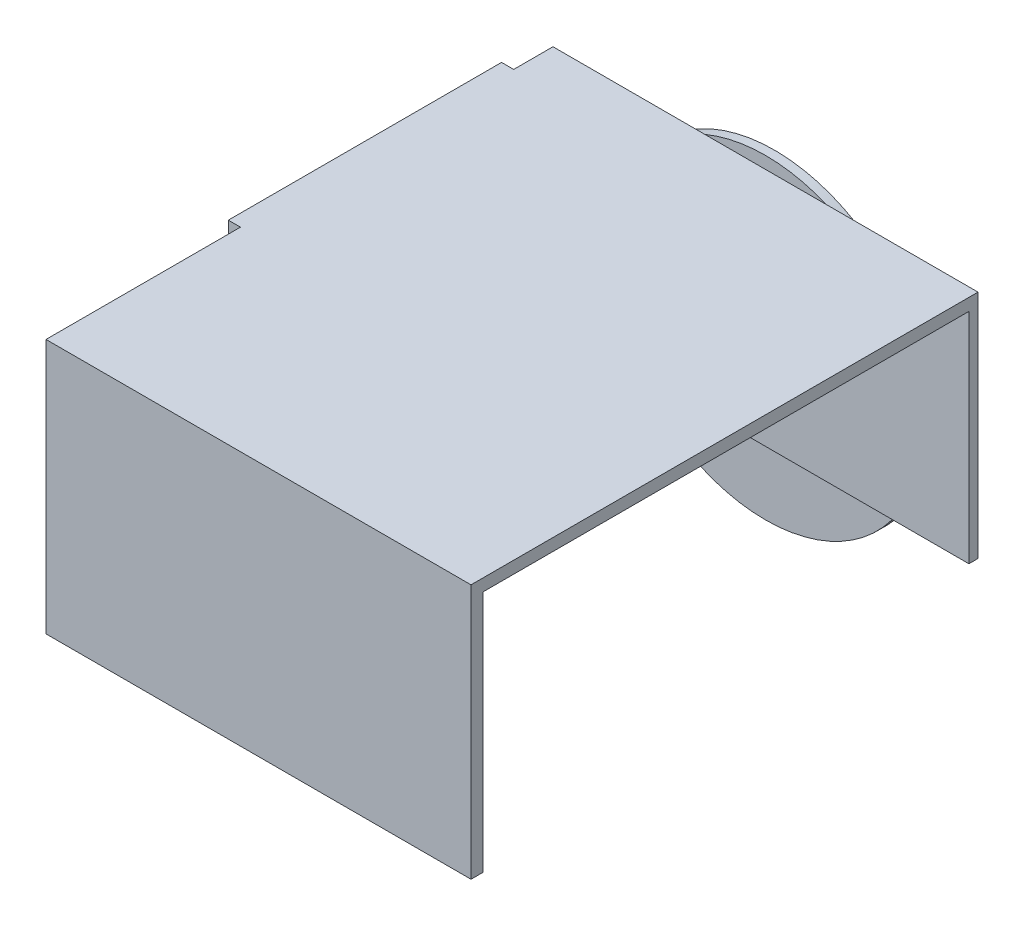
ISO-10303-21;
HEADER;
FILE_DESCRIPTION(('STEP AP214'),'2;1');
FILE_NAME('part.step','',(''),(''),'','','');
FILE_SCHEMA(('AUTOMOTIVE_DESIGN { 1 0 10303 214 1 1 1 1 }'));
ENDSEC;
DATA;
#1=APPLICATION_CONTEXT('core data for automotive mechanical design processes');
#2=APPLICATION_PROTOCOL_DEFINITION('international standard','automotive_design',2000,#1);
#3=PRODUCT_CONTEXT('',#1,'mechanical');
#4=PRODUCT('Part','Part','',(#3));
#5=PRODUCT_RELATED_PRODUCT_CATEGORY('part','',(#4));
#6=PRODUCT_DEFINITION_FORMATION('','',#4);
#7=PRODUCT_DEFINITION_CONTEXT('part definition',#1,'design');
#8=PRODUCT_DEFINITION('design','',#6,#7);
#9=PRODUCT_DEFINITION_SHAPE('','',#8);
#10=(LENGTH_UNIT() NAMED_UNIT(*) SI_UNIT(.MILLI.,.METRE.));
#11=(NAMED_UNIT(*) PLANE_ANGLE_UNIT() SI_UNIT($,.RADIAN.));
#12=(NAMED_UNIT(*) SI_UNIT($,.STERADIAN.) SOLID_ANGLE_UNIT());
#13=UNCERTAINTY_MEASURE_WITH_UNIT(LENGTH_MEASURE(1.E-05),#10,'distance_accuracy_value','');
#14=(GEOMETRIC_REPRESENTATION_CONTEXT(3) GLOBAL_UNCERTAINTY_ASSIGNED_CONTEXT((#13)) GLOBAL_UNIT_ASSIGNED_CONTEXT((#10,
#11,#12)) REPRESENTATION_CONTEXT('',''));
#15=CARTESIAN_POINT('',(0.,0.,0.));
#16=DIRECTION('',(0.,0.,1.));
#17=DIRECTION('',(1.,0.,0.));
#18=AXIS2_PLACEMENT_3D('',#15,#16,#17);
#19=CARTESIAN_POINT('',(-35.,24.,3.));
#20=DIRECTION('',(1.,0.,0.));
#21=DIRECTION('',(0.,0.,-1.));
#22=AXIS2_PLACEMENT_3D('',#19,#20,#21);
#23=PLANE('',#22);
#24=DIRECTION('',(0.,-1.,0.));
#25=VECTOR('',#24,1.);
#26=CARTESIAN_POINT('',(-35.,22.,7.97068975111986));
#27=LINE('',#26,#25);
#28=CARTESIAN_POINT('',(-35.,24.,7.97068975111987));
#29=VERTEX_POINT('',#28);
#30=CARTESIAN_POINT('',(-35.,22.,7.97068975111988));
#31=VERTEX_POINT('',#30);
#32=EDGE_CURVE('E57',#29,#31,#27,.T.);
#33=ORIENTED_EDGE('',*,*,#32,.F.);
#34=DIRECTION('',(0.,0.,-1.));
#35=VECTOR('',#34,1.);
#36=CARTESIAN_POINT('',(-35.,24.,3.));
#37=LINE('',#36,#35);
#38=CARTESIAN_POINT('',(-35.,24.,1.5));
#39=VERTEX_POINT('',#38);
#40=EDGE_CURVE('E250',#29,#39,#37,.T.);
#41=ORIENTED_EDGE('',*,*,#40,.T.);
#42=DIRECTION('',(0.,-1.,0.));
#43=VECTOR('',#42,1.);
#44=CARTESIAN_POINT('',(-35.,24.,1.5));
#45=LINE('',#44,#43);
#46=CARTESIAN_POINT('',(-35.,-14.,1.5));
#47=VERTEX_POINT('',#46);
#48=EDGE_CURVE('E230',#39,#47,#45,.T.);
#49=ORIENTED_EDGE('',*,*,#48,.T.);
#50=DIRECTION('',(0.,0.,-1.));
#51=VECTOR('',#50,1.);
#52=CARTESIAN_POINT('',(-35.,-14.,3.));
#53=LINE('',#52,#51);
#54=CARTESIAN_POINT('',(-35.,-14.,3.));
#55=VERTEX_POINT('',#54);
#56=EDGE_CURVE('E235',#55,#47,#53,.T.);
#57=ORIENTED_EDGE('',*,*,#56,.F.);
#58=DIRECTION('',(0.,-1.,0.));
#59=VECTOR('',#58,1.);
#60=CARTESIAN_POINT('',(-35.,24.,3.));
#61=LINE('',#60,#59);
#62=CARTESIAN_POINT('',(-35.,22.,3.));
#63=VERTEX_POINT('',#62);
#64=EDGE_CURVE('E233',#63,#55,#61,.T.);
#65=ORIENTED_EDGE('',*,*,#64,.F.);
#66=DIRECTION('',(0.,0.,-1.));
#67=VECTOR('',#66,1.);
#68=CARTESIAN_POINT('',(-35.,22.,85.));
#69=LINE('',#68,#67);
#70=EDGE_CURVE('E62',#31,#63,#69,.T.);
#71=ORIENTED_EDGE('',*,*,#70,.F.);
#72=EDGE_LOOP('',(#33,#41,#49,#57,#65,#71));
#73=FACE_BOUND('',#72,.T.);
#74=ADVANCED_FACE('F39',(#73),#23,.F.);
#75=DIRECTION('',(0.,1.,0.));
#76=VECTOR('',#75,1.);
#77=CARTESIAN_POINT('',(-35.,24.,52.9706897511199));
#78=LINE('',#77,#76);
#79=CARTESIAN_POINT('',(-35.,22.,52.9706897511199));
#80=VERTEX_POINT('',#79);
#81=CARTESIAN_POINT('',(-35.,24.,52.9706897511199));
#82=VERTEX_POINT('',#81);
#83=EDGE_CURVE('E11',#80,#82,#78,.T.);
#84=ORIENTED_EDGE('',*,*,#83,.F.);
#85=CARTESIAN_POINT('',(-35.,22.,83.));
#86=VERTEX_POINT('',#85);
#87=EDGE_CURVE('E222',#86,#80,#69,.T.);
#88=ORIENTED_EDGE('',*,*,#87,.F.);
#89=DIRECTION('',(0.,1.,0.));
#90=VECTOR('',#89,1.);
#91=CARTESIAN_POINT('',(-35.,-18.,83.));
#92=LINE('',#91,#90);
#93=CARTESIAN_POINT('',(-35.,-18.,83.));
#94=VERTEX_POINT('',#93);
#95=EDGE_CURVE('E207',#94,#86,#92,.T.);
#96=ORIENTED_EDGE('',*,*,#95,.F.);
#97=DIRECTION('',(0.,0.,-1.));
#98=VECTOR('',#97,1.);
#99=CARTESIAN_POINT('',(-35.,-18.,85.));
#100=LINE('',#99,#98);
#101=CARTESIAN_POINT('',(-35.,-18.,85.));
#102=VERTEX_POINT('',#101);
#103=EDGE_CURVE('E197',#102,#94,#100,.T.);
#104=ORIENTED_EDGE('',*,*,#103,.F.);
#105=DIRECTION('',(0.,-1.,0.));
#106=VECTOR('',#105,1.);
#107=CARTESIAN_POINT('',(-35.,24.,85.));
#108=LINE('',#107,#106);
#109=CARTESIAN_POINT('',(-35.,24.,85.));
#110=VERTEX_POINT('',#109);
#111=EDGE_CURVE('E213',#110,#102,#108,.T.);
#112=ORIENTED_EDGE('',*,*,#111,.F.);
#113=EDGE_CURVE('E251',#110,#82,#37,.T.);
#114=ORIENTED_EDGE('',*,*,#113,.T.);
#115=EDGE_LOOP('',(#84,#88,#96,#104,#112,#114));
#116=FACE_BOUND('',#115,.T.);
#117=ADVANCED_FACE('F291',(#116),#23,.F.);
#118=CARTESIAN_POINT('',(-35.,22.,85.));
#119=DIRECTION('',(0.,1.,0.));
#120=DIRECTION('',(0.,0.,1.));
#121=AXIS2_PLACEMENT_3D('',#118,#119,#120);
#122=PLANE('',#121);
#123=DIRECTION('',(1.,0.,0.));
#124=VECTOR('',#123,1.);
#125=CARTESIAN_POINT('',(-35.,22.,83.));
#126=LINE('',#125,#124);
#127=CARTESIAN_POINT('',(35.,22.,83.));
#128=VERTEX_POINT('',#127);
#129=EDGE_CURVE('E187',#86,#128,#126,.T.);
#130=ORIENTED_EDGE('',*,*,#129,.F.);
#131=ORIENTED_EDGE('',*,*,#87,.T.);
#132=EDGE_CURVE('E226',#80,#31,#69,.T.);
#133=ORIENTED_EDGE('',*,*,#132,.T.);
#134=ORIENTED_EDGE('',*,*,#70,.T.);
#135=DIRECTION('',(1.,0.,0.));
#136=VECTOR('',#135,1.);
#137=CARTESIAN_POINT('',(-35.,22.,3.));
#138=LINE('',#137,#136);
#139=CARTESIAN_POINT('',(35.,22.,3.));
#140=VERTEX_POINT('',#139);
#141=EDGE_CURVE('E209',#63,#140,#138,.T.);
#142=ORIENTED_EDGE('',*,*,#141,.T.);
#143=DIRECTION('',(0.,0.,-1.));
#144=VECTOR('',#143,1.);
#145=CARTESIAN_POINT('',(35.,22.,85.));
#146=LINE('',#145,#144);
#147=EDGE_CURVE('E218',#128,#140,#146,.T.);
#148=ORIENTED_EDGE('',*,*,#147,.F.);
#149=EDGE_LOOP('',(#130,#131,#133,#134,#142,#148));
#150=FACE_BOUND('',#149,.T.);
#151=ADVANCED_FACE('F296',(#150),#122,.F.);
#152=CARTESIAN_POINT('',(0.,0.,3.));
#153=DIRECTION('',(0.,0.,-1.));
#154=DIRECTION('',(-1.,0.,0.));
#155=AXIS2_PLACEMENT_3D('',#152,#153,#154);
#156=PLANE('',#155);
#157=ORIENTED_EDGE('',*,*,#141,.F.);
#158=ORIENTED_EDGE('',*,*,#64,.T.);
#159=DIRECTION('',(1.,0.,0.));
#160=VECTOR('',#159,1.);
#161=CARTESIAN_POINT('',(-35.,-14.,3.));
#162=LINE('',#161,#160);
#163=CARTESIAN_POINT('',(35.,-14.,3.));
#164=VERTEX_POINT('',#163);
#165=EDGE_CURVE('E227',#55,#164,#162,.T.);
#166=ORIENTED_EDGE('',*,*,#165,.T.);
#167=DIRECTION('',(0.,1.,0.));
#168=VECTOR('',#167,1.);
#169=CARTESIAN_POINT('',(35.,24.,3.));
#170=LINE('',#169,#168);
#171=EDGE_CURVE('E229',#164,#140,#170,.T.);
#172=ORIENTED_EDGE('',*,*,#171,.T.);
#173=EDGE_LOOP('',(#157,#158,#166,#172));
#174=FACE_BOUND('',#173,.T.);
#175=ADVANCED_FACE('F329',(#174),#156,.F.);
#176=CARTESIAN_POINT('',(0.,0.,1.5));
#177=DIRECTION('',(0.,0.,1.));
#178=DIRECTION('',(1.,0.,0.));
#179=AXIS2_PLACEMENT_3D('',#176,#177,#178);
#180=PLANE('',#179);
#181=DIRECTION('',(1.,0.,0.));
#182=VECTOR('',#181,1.);
#183=CARTESIAN_POINT('',(35.,-14.,1.5));
#184=LINE('',#183,#182);
#185=CARTESIAN_POINT('',(-21.9089023002066,-14.,1.5));
#186=VERTEX_POINT('',#185);
#187=CARTESIAN_POINT('',(21.9089023002066,-14.,1.5));
#188=VERTEX_POINT('',#187);
#189=EDGE_CURVE('E48',#186,#188,#184,.T.);
#190=ORIENTED_EDGE('',*,*,#189,.F.);
#191=CARTESIAN_POINT('',(0.,0.,1.5));
#192=DIRECTION('',(0.,0.,1.));
#193=DIRECTION('',(1.,0.,0.));
#194=AXIS2_PLACEMENT_3D('',#191,#192,#193);
#195=CIRCLE('',#194,26.);
#196=EDGE_CURVE('E266',#186,#188,#195,.T.);
#197=ORIENTED_EDGE('',*,*,#196,.T.);
#198=EDGE_LOOP('',(#190,#197));
#199=FACE_BOUND('',#198,.T.);
#200=ADVANCED_FACE('F289',(#199),#180,.T.);
#201=CARTESIAN_POINT('',(0.,0.,1.5));
#202=DIRECTION('',(0.,0.,-1.));
#203=DIRECTION('',(-1.,0.,0.));
#204=AXIS2_PLACEMENT_3D('',#201,#202,#203);
#205=CYLINDRICAL_SURFACE('',#204,26.);
#206=CARTESIAN_POINT('',(10.,24.,1.5));
#207=VERTEX_POINT('',#206);
#208=CARTESIAN_POINT('',(-10.,24.,1.5));
#209=VERTEX_POINT('',#208);
#210=EDGE_CURVE('E258',#207,#209,#195,.T.);
#211=ORIENTED_EDGE('',*,*,#210,.F.);
#212=EDGE_CURVE('E260',#188,#207,#195,.T.);
#213=ORIENTED_EDGE('',*,*,#212,.F.);
#214=ORIENTED_EDGE('',*,*,#196,.F.);
#215=EDGE_CURVE('E259',#209,#186,#195,.T.);
#216=ORIENTED_EDGE('',*,*,#215,.F.);
#217=EDGE_LOOP('',(#211,#213,#214,#216));
#218=FACE_BOUND('',#217,.T.);
#219=CARTESIAN_POINT('',(0.,0.,0.));
#220=DIRECTION('',(0.,0.,1.));
#221=DIRECTION('',(1.,0.,0.));
#222=AXIS2_PLACEMENT_3D('',#219,#220,#221);
#223=CIRCLE('',#222,26.);
#224=CARTESIAN_POINT('',(26.,0.,0.));
#225=VERTEX_POINT('',#224);
#226=EDGE_CURVE('E43',#225,#225,#223,.T.);
#227=ORIENTED_EDGE('',*,*,#226,.T.);
#228=EDGE_LOOP('',(#227));
#229=FACE_BOUND('',#228,.T.);
#230=ADVANCED_FACE('F41',(#218,#229),#205,.T.);
#231=DIRECTION('',(-1.,0.,0.));
#232=VECTOR('',#231,1.);
#233=CARTESIAN_POINT('',(-35.,24.,1.5));
#234=LINE('',#233,#232);
#235=EDGE_CURVE('E245',#207,#209,#234,.T.);
#236=ORIENTED_EDGE('',*,*,#235,.F.);
#237=ORIENTED_EDGE('',*,*,#210,.T.);
#238=EDGE_LOOP('',(#236,#237));
#239=FACE_BOUND('',#238,.T.);
#240=ADVANCED_FACE('F279',(#239),#180,.T.);
#241=CARTESIAN_POINT('',(0.,0.,0.));
#242=DIRECTION('',(0.,0.,1.));
#243=DIRECTION('',(1.,0.,0.));
#244=AXIS2_PLACEMENT_3D('',#241,#242,#243);
#245=PLANE('',#244);
#246=ORIENTED_EDGE('',*,*,#226,.F.);
#247=EDGE_LOOP('',(#246));
#248=FACE_BOUND('',#247,.T.);
#249=ADVANCED_FACE('F276',(#248),#245,.F.);
#250=CARTESIAN_POINT('',(0.,0.,1.5));
#251=DIRECTION('',(0.,0.,-1.));
#252=DIRECTION('',(-1.,0.,0.));
#253=AXIS2_PLACEMENT_3D('',#250,#251,#252);
#254=PLANE('',#253);
#255=EDGE_CURVE('E241',#209,#39,#234,.T.);
#256=ORIENTED_EDGE('',*,*,#255,.F.);
#257=ORIENTED_EDGE('',*,*,#215,.T.);
#258=EDGE_CURVE('E236',#47,#186,#184,.T.);
#259=ORIENTED_EDGE('',*,*,#258,.F.);
#260=ORIENTED_EDGE('',*,*,#48,.F.);
#261=EDGE_LOOP('',(#256,#257,#259,#260));
#262=FACE_BOUND('',#261,.T.);
#263=ADVANCED_FACE('F278',(#262),#254,.T.);
#264=CARTESIAN_POINT('',(35.,-14.,3.));
#265=DIRECTION('',(0.,1.,0.));
#266=DIRECTION('',(0.,0.,1.));
#267=AXIS2_PLACEMENT_3D('',#264,#265,#266);
#268=PLANE('',#267);
#269=ORIENTED_EDGE('',*,*,#258,.T.);
#270=ORIENTED_EDGE('',*,*,#189,.T.);
#271=CARTESIAN_POINT('',(35.,-14.,1.5));
#272=VERTEX_POINT('',#271);
#273=EDGE_CURVE('E225',#188,#272,#184,.T.);
#274=ORIENTED_EDGE('',*,*,#273,.T.);
#275=DIRECTION('',(0.,0.,-1.));
#276=VECTOR('',#275,1.);
#277=CARTESIAN_POINT('',(35.,-14.,3.));
#278=LINE('',#277,#276);
#279=EDGE_CURVE('E256',#164,#272,#278,.T.);
#280=ORIENTED_EDGE('',*,*,#279,.F.);
#281=ORIENTED_EDGE('',*,*,#165,.F.);
#282=ORIENTED_EDGE('',*,*,#56,.T.);
#283=EDGE_LOOP('',(#269,#270,#274,#280,#281,#282));
#284=FACE_BOUND('',#283,.T.);
#285=ADVANCED_FACE('F284',(#284),#268,.F.);
#286=CARTESIAN_POINT('',(35.,24.,3.));
#287=DIRECTION('',(-1.,0.,0.));
#288=DIRECTION('',(0.,0.,1.));
#289=AXIS2_PLACEMENT_3D('',#286,#287,#288);
#290=PLANE('',#289);
#291=DIRECTION('',(0.,1.,0.));
#292=VECTOR('',#291,1.);
#293=CARTESIAN_POINT('',(35.,24.,1.5));
#294=LINE('',#293,#292);
#295=CARTESIAN_POINT('',(35.,24.,1.5));
#296=VERTEX_POINT('',#295);
#297=EDGE_CURVE('E239',#272,#296,#294,.T.);
#298=ORIENTED_EDGE('',*,*,#297,.T.);
#299=DIRECTION('',(0.,0.,-1.));
#300=VECTOR('',#299,1.);
#301=CARTESIAN_POINT('',(35.,24.,3.));
#302=LINE('',#301,#300);
#303=CARTESIAN_POINT('',(35.,24.,85.));
#304=VERTEX_POINT('',#303);
#305=EDGE_CURVE('E253',#304,#296,#302,.T.);
#306=ORIENTED_EDGE('',*,*,#305,.F.);
#307=DIRECTION('',(0.,1.,0.));
#308=VECTOR('',#307,1.);
#309=CARTESIAN_POINT('',(35.,22.,85.));
#310=LINE('',#309,#308);
#311=CARTESIAN_POINT('',(35.,-18.,85.));
#312=VERTEX_POINT('',#311);
#313=EDGE_CURVE('E215',#312,#304,#310,.T.);
#314=ORIENTED_EDGE('',*,*,#313,.F.);
#315=DIRECTION('',(0.,0.,1.));
#316=VECTOR('',#315,1.);
#317=CARTESIAN_POINT('',(35.,-18.,83.));
#318=LINE('',#317,#316);
#319=CARTESIAN_POINT('',(35.,-18.,83.));
#320=VERTEX_POINT('',#319);
#321=EDGE_CURVE('E201',#320,#312,#318,.T.);
#322=ORIENTED_EDGE('',*,*,#321,.F.);
#323=DIRECTION('',(0.,1.,0.));
#324=VECTOR('',#323,1.);
#325=CARTESIAN_POINT('',(35.,-18.,83.));
#326=LINE('',#325,#324);
#327=EDGE_CURVE('E203',#320,#128,#326,.T.);
#328=ORIENTED_EDGE('',*,*,#327,.T.);
#329=ORIENTED_EDGE('',*,*,#147,.T.);
#330=ORIENTED_EDGE('',*,*,#171,.F.);
#331=ORIENTED_EDGE('',*,*,#279,.T.);
#332=EDGE_LOOP('',(#298,#306,#314,#322,#328,#329,#330,#331));
#333=FACE_BOUND('',#332,.T.);
#334=ADVANCED_FACE('F303',(#333),#290,.F.);
#335=CARTESIAN_POINT('',(-35.,24.,3.));
#336=DIRECTION('',(0.,-1.,0.));
#337=DIRECTION('',(0.,0.,-1.));
#338=AXIS2_PLACEMENT_3D('',#335,#336,#337);
#339=PLANE('',#338);
#340=EDGE_CURVE('E242',#296,#207,#234,.T.);
#341=ORIENTED_EDGE('',*,*,#340,.T.);
#342=ORIENTED_EDGE('',*,*,#235,.T.);
#343=ORIENTED_EDGE('',*,*,#255,.T.);
#344=ORIENTED_EDGE('',*,*,#40,.F.);
#345=DIRECTION('',(1.,0.,0.));
#346=VECTOR('',#345,1.);
#347=CARTESIAN_POINT('',(-37.,24.,7.97068975111988));
#348=LINE('',#347,#346);
#349=CARTESIAN_POINT('',(-37.,24.,7.97068975111988));
#350=VERTEX_POINT('',#349);
#351=EDGE_CURVE('E191',#350,#29,#348,.T.);
#352=ORIENTED_EDGE('',*,*,#351,.F.);
#353=DIRECTION('',(0.,0.,-1.));
#354=VECTOR('',#353,1.);
#355=CARTESIAN_POINT('',(-37.,24.,7.97068975111988));
#356=LINE('',#355,#354);
#357=CARTESIAN_POINT('',(-37.,24.,52.9706897511199));
#358=VERTEX_POINT('',#357);
#359=EDGE_CURVE('E171',#358,#350,#356,.T.);
#360=ORIENTED_EDGE('',*,*,#359,.F.);
#361=DIRECTION('',(1.,0.,0.));
#362=VECTOR('',#361,1.);
#363=CARTESIAN_POINT('',(-37.,24.,52.9706897511199));
#364=LINE('',#363,#362);
#365=EDGE_CURVE('E168',#358,#82,#364,.T.);
#366=ORIENTED_EDGE('',*,*,#365,.T.);
#367=ORIENTED_EDGE('',*,*,#113,.F.);
#368=DIRECTION('',(-1.,0.,0.));
#369=VECTOR('',#368,1.);
#370=CARTESIAN_POINT('',(35.,24.,85.));
#371=LINE('',#370,#369);
#372=EDGE_CURVE('E210',#304,#110,#371,.T.);
#373=ORIENTED_EDGE('',*,*,#372,.F.);
#374=ORIENTED_EDGE('',*,*,#305,.T.);
#375=EDGE_LOOP('',(#341,#342,#343,#344,#352,#360,#366,#367,#373,#374));
#376=FACE_BOUND('',#375,.T.);
#377=ADVANCED_FACE('F300',(#376),#339,.F.);
#378=ORIENTED_EDGE('',*,*,#273,.F.);
#379=ORIENTED_EDGE('',*,*,#212,.T.);
#380=ORIENTED_EDGE('',*,*,#340,.F.);
#381=ORIENTED_EDGE('',*,*,#297,.F.);
#382=EDGE_LOOP('',(#378,#379,#380,#381));
#383=FACE_BOUND('',#382,.T.);
#384=ADVANCED_FACE('F287',(#383),#254,.T.);
#385=CARTESIAN_POINT('',(0.,0.,85.));
#386=DIRECTION('',(0.,0.,1.));
#387=DIRECTION('',(1.,0.,0.));
#388=AXIS2_PLACEMENT_3D('',#385,#386,#387);
#389=PLANE('',#388);
#390=ORIENTED_EDGE('',*,*,#372,.T.);
#391=ORIENTED_EDGE('',*,*,#111,.T.);
#392=DIRECTION('',(-1.,0.,0.));
#393=VECTOR('',#392,1.);
#394=CARTESIAN_POINT('',(35.,-18.,85.));
#395=LINE('',#394,#393);
#396=EDGE_CURVE('E189',#312,#102,#395,.T.);
#397=ORIENTED_EDGE('',*,*,#396,.F.);
#398=ORIENTED_EDGE('',*,*,#313,.T.);
#399=EDGE_LOOP('',(#390,#391,#397,#398));
#400=FACE_BOUND('',#399,.T.);
#401=ADVANCED_FACE('F407',(#400),#389,.T.);
#402=CARTESIAN_POINT('',(-35.,-18.,83.));
#403=DIRECTION('',(0.,0.,1.));
#404=DIRECTION('',(1.,0.,0.));
#405=AXIS2_PLACEMENT_3D('',#402,#403,#404);
#406=PLANE('',#405);
#407=ORIENTED_EDGE('',*,*,#129,.T.);
#408=ORIENTED_EDGE('',*,*,#327,.F.);
#409=DIRECTION('',(1.,0.,0.));
#410=VECTOR('',#409,1.);
#411=CARTESIAN_POINT('',(-35.,-18.,83.));
#412=LINE('',#411,#410);
#413=EDGE_CURVE('E199',#94,#320,#412,.T.);
#414=ORIENTED_EDGE('',*,*,#413,.F.);
#415=ORIENTED_EDGE('',*,*,#95,.T.);
#416=EDGE_LOOP('',(#407,#408,#414,#415));
#417=FACE_BOUND('',#416,.T.);
#418=ADVANCED_FACE('F403',(#417),#406,.F.);
#419=CARTESIAN_POINT('',(0.,-18.,0.));
#420=DIRECTION('',(0.,-1.,0.));
#421=DIRECTION('',(0.,0.,-1.));
#422=AXIS2_PLACEMENT_3D('',#419,#420,#421);
#423=PLANE('',#422);
#424=ORIENTED_EDGE('',*,*,#396,.T.);
#425=ORIENTED_EDGE('',*,*,#103,.T.);
#426=ORIENTED_EDGE('',*,*,#413,.T.);
#427=ORIENTED_EDGE('',*,*,#321,.T.);
#428=EDGE_LOOP('',(#424,#425,#426,#427));
#429=FACE_BOUND('',#428,.T.);
#430=ADVANCED_FACE('F391',(#429),#423,.T.);
#431=CARTESIAN_POINT('',(-35.,0.,0.));
#432=DIRECTION('',(1.,0.,0.));
#433=DIRECTION('',(0.,0.,-1.));
#434=AXIS2_PLACEMENT_3D('',#431,#432,#433);
#435=PLANE('',#434);
#436=CARTESIAN_POINT('',(-35.,2.,30.4706897511199));
#437=DIRECTION('',(-1.,0.,0.));
#438=DIRECTION('',(0.,0.,1.));
#439=AXIS2_PLACEMENT_3D('',#436,#437,#438);
#440=CIRCLE('',#439,18.5);
#441=CARTESIAN_POINT('',(-35.,2.,48.9706897511198));
#442=VERTEX_POINT('',#441);
#443=EDGE_CURVE('E369',#442,#442,#440,.T.);
#444=ORIENTED_EDGE('',*,*,#443,.T.);
#445=EDGE_LOOP('',(#444));
#446=FACE_BOUND('',#445,.T.);
#447=ORIENTED_EDGE('',*,*,#132,.F.);
#448=CARTESIAN_POINT('',(-35.,-11.,52.9706897511199));
#449=VERTEX_POINT('',#448);
#450=EDGE_CURVE('E50',#449,#80,#78,.T.);
#451=ORIENTED_EDGE('',*,*,#450,.F.);
#452=DIRECTION('',(0.,0.,-1.));
#453=VECTOR('',#452,1.);
#454=CARTESIAN_POINT('',(-35.,-11.,52.9706897511199));
#455=LINE('',#454,#453);
#456=CARTESIAN_POINT('',(-35.,-11.,77.9706897511199));
#457=VERTEX_POINT('',#456);
#458=EDGE_CURVE('E186',#457,#449,#455,.T.);
#459=ORIENTED_EDGE('',*,*,#458,.F.);
#460=DIRECTION('',(0.,1.,0.));
#461=VECTOR('',#460,1.);
#462=CARTESIAN_POINT('',(-35.,-11.,77.9706897511199));
#463=LINE('',#462,#461);
#464=CARTESIAN_POINT('',(-35.,-18.,77.9706897511199));
#465=VERTEX_POINT('',#464);
#466=EDGE_CURVE('E182',#465,#457,#463,.T.);
#467=ORIENTED_EDGE('',*,*,#466,.F.);
#468=DIRECTION('',(0.,0.,1.));
#469=VECTOR('',#468,1.);
#470=CARTESIAN_POINT('',(-35.,-18.,7.97068975111986));
#471=LINE('',#470,#469);
#472=CARTESIAN_POINT('',(-35.,-18.,7.97068975111986));
#473=VERTEX_POINT('',#472);
#474=EDGE_CURVE('E340',#473,#465,#471,.T.);
#475=ORIENTED_EDGE('',*,*,#474,.F.);
#476=EDGE_CURVE('E337',#31,#473,#27,.T.);
#477=ORIENTED_EDGE('',*,*,#476,.F.);
#478=EDGE_LOOP('',(#447,#451,#459,#467,#475,#477));
#479=FACE_BOUND('',#478,.T.);
#480=ADVANCED_FACE('F338',(#446,#479),#435,.T.);
#481=CARTESIAN_POINT('',(-37.,0.,0.));
#482=DIRECTION('',(1.,0.,0.));
#483=DIRECTION('',(0.,0.,-1.));
#484=AXIS2_PLACEMENT_3D('',#481,#482,#483);
#485=PLANE('',#484);
#486=DIRECTION('',(0.,0.,-1.));
#487=VECTOR('',#486,1.);
#488=CARTESIAN_POINT('',(-37.,-11.,52.9706897511199));
#489=LINE('',#488,#487);
#490=CARTESIAN_POINT('',(-37.,-11.,77.9706897511199));
#491=VERTEX_POINT('',#490);
#492=CARTESIAN_POINT('',(-37.,-11.,52.9706897511199));
#493=VERTEX_POINT('',#492);
#494=EDGE_CURVE('E172',#491,#493,#489,.T.);
#495=ORIENTED_EDGE('',*,*,#494,.T.);
#496=DIRECTION('',(0.,1.,0.));
#497=VECTOR('',#496,1.);
#498=CARTESIAN_POINT('',(-37.,22.,52.9706897511199));
#499=LINE('',#498,#497);
#500=EDGE_CURVE('E160',#493,#358,#499,.T.);
#501=ORIENTED_EDGE('',*,*,#500,.T.);
#502=ORIENTED_EDGE('',*,*,#359,.T.);
#503=DIRECTION('',(0.,-1.,0.));
#504=VECTOR('',#503,1.);
#505=CARTESIAN_POINT('',(-37.,22.,7.97068975111986));
#506=LINE('',#505,#504);
#507=CARTESIAN_POINT('',(-37.,-18.,7.97068975111986));
#508=VERTEX_POINT('',#507);
#509=EDGE_CURVE('E362',#350,#508,#506,.T.);
#510=ORIENTED_EDGE('',*,*,#509,.T.);
#511=DIRECTION('',(0.,0.,1.));
#512=VECTOR('',#511,1.);
#513=CARTESIAN_POINT('',(-37.,-18.,7.97068975111986));
#514=LINE('',#513,#512);
#515=CARTESIAN_POINT('',(-37.,-18.,77.9706897511199));
#516=VERTEX_POINT('',#515);
#517=EDGE_CURVE('E361',#508,#516,#514,.T.);
#518=ORIENTED_EDGE('',*,*,#517,.T.);
#519=DIRECTION('',(0.,1.,0.));
#520=VECTOR('',#519,1.);
#521=CARTESIAN_POINT('',(-37.,-11.,77.9706897511199));
#522=LINE('',#521,#520);
#523=EDGE_CURVE('E178',#516,#491,#522,.T.);
#524=ORIENTED_EDGE('',*,*,#523,.T.);
#525=EDGE_LOOP('',(#495,#501,#502,#510,#518,#524));
#526=FACE_BOUND('',#525,.T.);
#527=CARTESIAN_POINT('',(-37.,2.,30.4706897511199));
#528=DIRECTION('',(-1.,0.,0.));
#529=DIRECTION('',(0.,0.,1.));
#530=AXIS2_PLACEMENT_3D('',#527,#528,#529);
#531=CIRCLE('',#530,18.5);
#532=CARTESIAN_POINT('',(-37.,2.,48.9706897511198));
#533=VERTEX_POINT('',#532);
#534=EDGE_CURVE('E367',#533,#533,#531,.T.);
#535=ORIENTED_EDGE('',*,*,#534,.F.);
#536=EDGE_LOOP('',(#535));
#537=FACE_BOUND('',#536,.T.);
#538=ADVANCED_FACE('F175',(#526,#537),#485,.F.);
#539=CARTESIAN_POINT('',(-37.,-11.,52.9706897511199));
#540=DIRECTION('',(0.,-1.,0.));
#541=DIRECTION('',(0.,0.,-1.));
#542=AXIS2_PLACEMENT_3D('',#539,#540,#541);
#543=PLANE('',#542);
#544=ORIENTED_EDGE('',*,*,#458,.T.);
#545=DIRECTION('',(1.,0.,0.));
#546=VECTOR('',#545,1.);
#547=CARTESIAN_POINT('',(-37.,-11.,52.9706897511199));
#548=LINE('',#547,#546);
#549=EDGE_CURVE('E165',#493,#449,#548,.T.);
#550=ORIENTED_EDGE('',*,*,#549,.F.);
#551=ORIENTED_EDGE('',*,*,#494,.F.);
#552=DIRECTION('',(1.,0.,0.));
#553=VECTOR('',#552,1.);
#554=CARTESIAN_POINT('',(-37.,-11.,77.9706897511199));
#555=LINE('',#554,#553);
#556=EDGE_CURVE('E351',#491,#457,#555,.T.);
#557=ORIENTED_EDGE('',*,*,#556,.T.);
#558=EDGE_LOOP('',(#544,#550,#551,#557));
#559=FACE_BOUND('',#558,.T.);
#560=ADVANCED_FACE('F184',(#559),#543,.F.);
#561=CARTESIAN_POINT('',(-37.,24.,52.9706897511199));
#562=DIRECTION('',(0.,0.,-1.));
#563=DIRECTION('',(0.,1.,0.));
#564=AXIS2_PLACEMENT_3D('',#561,#562,#563);
#565=PLANE('',#564);
#566=ORIENTED_EDGE('',*,*,#450,.T.);
#567=ORIENTED_EDGE('',*,*,#83,.T.);
#568=ORIENTED_EDGE('',*,*,#365,.F.);
#569=ORIENTED_EDGE('',*,*,#500,.F.);
#570=ORIENTED_EDGE('',*,*,#549,.T.);
#571=EDGE_LOOP('',(#566,#567,#568,#569,#570));
#572=FACE_BOUND('',#571,.T.);
#573=ADVANCED_FACE('F163',(#572),#565,.F.);
#574=CARTESIAN_POINT('',(-37.,22.,7.97068975111986));
#575=DIRECTION('',(0.,0.,1.));
#576=DIRECTION('',(1.,0.,0.));
#577=AXIS2_PLACEMENT_3D('',#574,#575,#576);
#578=PLANE('',#577);
#579=ORIENTED_EDGE('',*,*,#32,.T.);
#580=ORIENTED_EDGE('',*,*,#476,.T.);
#581=DIRECTION('',(1.,0.,0.));
#582=VECTOR('',#581,1.);
#583=CARTESIAN_POINT('',(-37.,-18.,7.97068975111986));
#584=LINE('',#583,#582);
#585=EDGE_CURVE('E356',#508,#473,#584,.T.);
#586=ORIENTED_EDGE('',*,*,#585,.F.);
#587=ORIENTED_EDGE('',*,*,#509,.F.);
#588=ORIENTED_EDGE('',*,*,#351,.T.);
#589=EDGE_LOOP('',(#579,#580,#586,#587,#588));
#590=FACE_BOUND('',#589,.T.);
#591=ADVANCED_FACE('F345',(#590),#578,.F.);
#592=CARTESIAN_POINT('',(-37.,-18.,7.97068975111986));
#593=DIRECTION('',(0.,1.,0.));
#594=DIRECTION('',(0.,0.,1.));
#595=AXIS2_PLACEMENT_3D('',#592,#593,#594);
#596=PLANE('',#595);
#597=ORIENTED_EDGE('',*,*,#474,.T.);
#598=DIRECTION('',(1.,0.,0.));
#599=VECTOR('',#598,1.);
#600=CARTESIAN_POINT('',(-37.,-18.,77.9706897511199));
#601=LINE('',#600,#599);
#602=EDGE_CURVE('E353',#516,#465,#601,.T.);
#603=ORIENTED_EDGE('',*,*,#602,.F.);
#604=ORIENTED_EDGE('',*,*,#517,.F.);
#605=ORIENTED_EDGE('',*,*,#585,.T.);
#606=EDGE_LOOP('',(#597,#603,#604,#605));
#607=FACE_BOUND('',#606,.T.);
#608=ADVANCED_FACE('F359',(#607),#596,.F.);
#609=CARTESIAN_POINT('',(-37.,-11.,77.9706897511199));
#610=DIRECTION('',(0.,0.,-1.));
#611=DIRECTION('',(-1.,0.,0.));
#612=AXIS2_PLACEMENT_3D('',#609,#610,#611);
#613=PLANE('',#612);
#614=ORIENTED_EDGE('',*,*,#466,.T.);
#615=ORIENTED_EDGE('',*,*,#556,.F.);
#616=ORIENTED_EDGE('',*,*,#523,.F.);
#617=ORIENTED_EDGE('',*,*,#602,.T.);
#618=EDGE_LOOP('',(#614,#615,#616,#617));
#619=FACE_BOUND('',#618,.T.);
#620=ADVANCED_FACE('F380',(#619),#613,.F.);
#621=CARTESIAN_POINT('',(-37.,2.,30.4706897511199));
#622=DIRECTION('',(1.,0.,0.));
#623=DIRECTION('',(0.,0.,-1.));
#624=AXIS2_PLACEMENT_3D('',#621,#622,#623);
#625=CYLINDRICAL_SURFACE('',#624,18.5);
#626=ORIENTED_EDGE('',*,*,#534,.T.);
#627=EDGE_LOOP('',(#626));
#628=FACE_BOUND('',#627,.T.);
#629=ORIENTED_EDGE('',*,*,#443,.F.);
#630=EDGE_LOOP('',(#629));
#631=FACE_BOUND('',#630,.T.);
#632=ADVANCED_FACE('F378',(#628,#631),#625,.F.);
#633=CLOSED_SHELL('',(#74,#117,#151,#175,#200,#230,#240,#249,#263,#285,#334,#377,#384,#401,#418,
#430,#480,#538,#560,#573,#591,#608,#620,#632));
#634=MANIFOLD_SOLID_BREP('B2',#633);
#635=ADVANCED_BREP_SHAPE_REPRESENTATION('',(#18,#634),#14);
#636=SHAPE_DEFINITION_REPRESENTATION(#9,#635);
ENDSEC;
END-ISO-10303-21;
